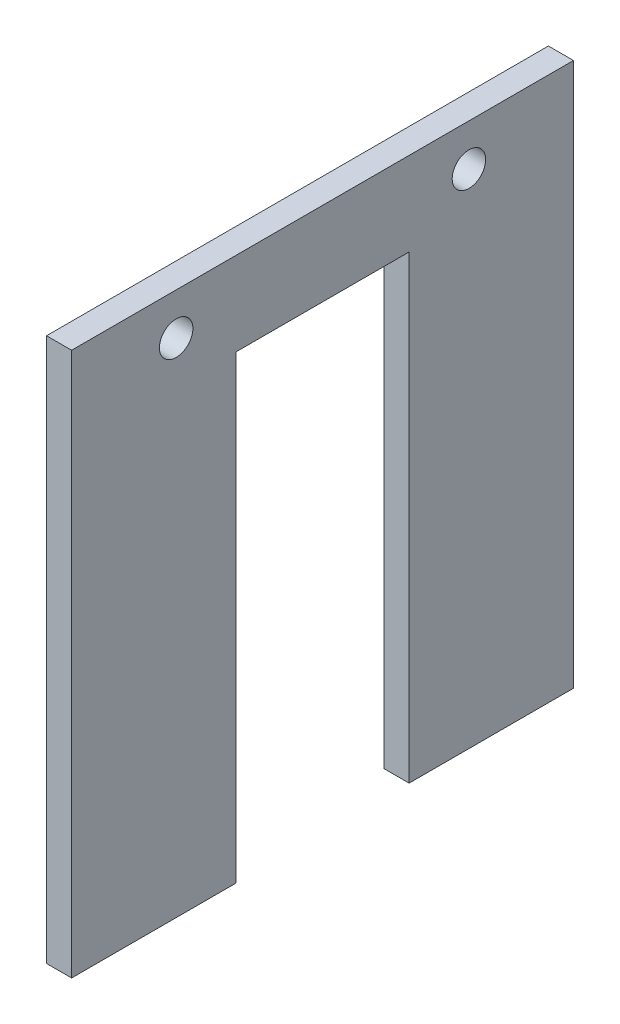
ISO-10303-21;
HEADER;
FILE_DESCRIPTION(('STEP AP214'),'2;1');
FILE_NAME('part.step','',(''),(''),'','','');
FILE_SCHEMA(('AUTOMOTIVE_DESIGN { 1 0 10303 214 1 1 1 1 }'));
ENDSEC;
DATA;
#1=APPLICATION_CONTEXT('core data for automotive mechanical design processes');
#2=APPLICATION_PROTOCOL_DEFINITION('international standard','automotive_design',2000,#1);
#3=PRODUCT_CONTEXT('',#1,'mechanical');
#4=PRODUCT('Part','Part','',(#3));
#5=PRODUCT_RELATED_PRODUCT_CATEGORY('part','',(#4));
#6=PRODUCT_DEFINITION_FORMATION('','',#4);
#7=PRODUCT_DEFINITION_CONTEXT('part definition',#1,'design');
#8=PRODUCT_DEFINITION('design','',#6,#7);
#9=PRODUCT_DEFINITION_SHAPE('','',#8);
#10=(LENGTH_UNIT() NAMED_UNIT(*) SI_UNIT(.MILLI.,.METRE.));
#11=(NAMED_UNIT(*) PLANE_ANGLE_UNIT() SI_UNIT($,.RADIAN.));
#12=(NAMED_UNIT(*) SI_UNIT($,.STERADIAN.) SOLID_ANGLE_UNIT());
#13=UNCERTAINTY_MEASURE_WITH_UNIT(LENGTH_MEASURE(1.E-05),#10,'distance_accuracy_value','');
#14=(GEOMETRIC_REPRESENTATION_CONTEXT(3) GLOBAL_UNCERTAINTY_ASSIGNED_CONTEXT((#13)) GLOBAL_UNIT_ASSIGNED_CONTEXT((#10,
#11,#12)) REPRESENTATION_CONTEXT('',''));
#15=CARTESIAN_POINT('',(0.,0.,0.));
#16=DIRECTION('',(0.,0.,1.));
#17=DIRECTION('',(1.,0.,0.));
#18=AXIS2_PLACEMENT_3D('',#15,#16,#17);
#19=CARTESIAN_POINT('',(3.,0.,0.));
#20=DIRECTION('',(1.,0.,0.));
#21=DIRECTION('',(0.,0.,-1.));
#22=AXIS2_PLACEMENT_3D('',#19,#20,#21);
#23=PLANE('',#22);
#24=CARTESIAN_POINT('',(3.,60.,-12.5));
#25=DIRECTION('',(1.,0.,0.));
#26=DIRECTION('',(0.,0.,-1.));
#27=AXIS2_PLACEMENT_3D('',#24,#25,#26);
#28=CIRCLE('',#27,2.);
#29=CARTESIAN_POINT('',(3.,60.,-14.5));
#30=VERTEX_POINT('',#29);
#31=EDGE_CURVE('E134',#30,#30,#28,.T.);
#32=ORIENTED_EDGE('',*,*,#31,.F.);
#33=EDGE_LOOP('',(#32));
#34=FACE_BOUND('',#33,.T.);
#35=DIRECTION('',(0.,0.,-1.));
#36=VECTOR('',#35,1.);
#37=CARTESIAN_POINT('',(3.,55.,-40.35));
#38=LINE('',#37,#36);
#39=CARTESIAN_POINT('',(3.,55.,-19.65));
#40=VERTEX_POINT('',#39);
#41=CARTESIAN_POINT('',(3.,55.,-40.35));
#42=VERTEX_POINT('',#41);
#43=EDGE_CURVE('E145',#40,#42,#38,.T.);
#44=ORIENTED_EDGE('',*,*,#43,.T.);
#45=DIRECTION('',(0.,-1.,0.));
#46=VECTOR('',#45,1.);
#47=CARTESIAN_POINT('',(3.,0.,-40.35));
#48=LINE('',#47,#46);
#49=CARTESIAN_POINT('',(3.,0.,-40.35));
#50=VERTEX_POINT('',#49);
#51=EDGE_CURVE('E93',#42,#50,#48,.T.);
#52=ORIENTED_EDGE('',*,*,#51,.T.);
#53=DIRECTION('',(0.,0.,-1.));
#54=VECTOR('',#53,1.);
#55=CARTESIAN_POINT('',(3.,0.,-40.35));
#56=LINE('',#55,#54);
#57=CARTESIAN_POINT('',(3.,0.,-60.));
#58=VERTEX_POINT('',#57);
#59=EDGE_CURVE('E160',#50,#58,#56,.T.);
#60=ORIENTED_EDGE('',*,*,#59,.T.);
#61=DIRECTION('',(0.,1.,0.));
#62=VECTOR('',#61,1.);
#63=CARTESIAN_POINT('',(3.,0.,-60.));
#64=LINE('',#63,#62);
#65=CARTESIAN_POINT('',(3.,65.,-60.));
#66=VERTEX_POINT('',#65);
#67=EDGE_CURVE('E173',#58,#66,#64,.T.);
#68=ORIENTED_EDGE('',*,*,#67,.T.);
#69=DIRECTION('',(0.,0.,1.));
#70=VECTOR('',#69,1.);
#71=CARTESIAN_POINT('',(3.,65.,-60.));
#72=LINE('',#71,#70);
#73=CARTESIAN_POINT('',(3.,65.,0.));
#74=VERTEX_POINT('',#73);
#75=EDGE_CURVE('E112',#66,#74,#72,.T.);
#76=ORIENTED_EDGE('',*,*,#75,.T.);
#77=DIRECTION('',(0.,-1.,0.));
#78=VECTOR('',#77,1.);
#79=CARTESIAN_POINT('',(3.,0.,0.));
#80=LINE('',#79,#78);
#81=CARTESIAN_POINT('',(3.,0.,0.));
#82=VERTEX_POINT('',#81);
#83=EDGE_CURVE('E106',#74,#82,#80,.T.);
#84=ORIENTED_EDGE('',*,*,#83,.T.);
#85=DIRECTION('',(0.,0.,-1.));
#86=VECTOR('',#85,1.);
#87=CARTESIAN_POINT('',(3.,0.,-19.65));
#88=LINE('',#87,#86);
#89=CARTESIAN_POINT('',(3.,0.,-19.65));
#90=VERTEX_POINT('',#89);
#91=EDGE_CURVE('E110',#82,#90,#88,.T.);
#92=ORIENTED_EDGE('',*,*,#91,.T.);
#93=DIRECTION('',(0.,1.,0.));
#94=VECTOR('',#93,1.);
#95=CARTESIAN_POINT('',(3.,55.,-19.65));
#96=LINE('',#95,#94);
#97=EDGE_CURVE('E50',#90,#40,#96,.T.);
#98=ORIENTED_EDGE('',*,*,#97,.T.);
#99=EDGE_LOOP('',(#44,#52,#60,#68,#76,#84,#92,#98));
#100=FACE_BOUND('',#99,.T.);
#101=CARTESIAN_POINT('',(3.,60.,-47.5));
#102=DIRECTION('',(1.,0.,0.));
#103=DIRECTION('',(0.,0.,-1.));
#104=AXIS2_PLACEMENT_3D('',#101,#102,#103);
#105=CIRCLE('',#104,2.);
#106=CARTESIAN_POINT('',(3.,60.,-49.5));
#107=VERTEX_POINT('',#106);
#108=EDGE_CURVE('E182',#107,#107,#105,.T.);
#109=ORIENTED_EDGE('',*,*,#108,.F.);
#110=EDGE_LOOP('',(#109));
#111=FACE_BOUND('',#110,.T.);
#112=ADVANCED_FACE('F33',(#34,#100,#111),#23,.T.);
#113=CARTESIAN_POINT('',(0.,0.,0.));
#114=DIRECTION('',(1.,0.,0.));
#115=DIRECTION('',(0.,0.,-1.));
#116=AXIS2_PLACEMENT_3D('',#113,#114,#115);
#117=PLANE('',#116);
#118=DIRECTION('',(0.,0.,-1.));
#119=VECTOR('',#118,1.);
#120=CARTESIAN_POINT('',(0.,55.,-40.35));
#121=LINE('',#120,#119);
#122=CARTESIAN_POINT('',(0.,55.,-19.65));
#123=VERTEX_POINT('',#122);
#124=CARTESIAN_POINT('',(0.,55.,-40.35));
#125=VERTEX_POINT('',#124);
#126=EDGE_CURVE('E130',#123,#125,#121,.T.);
#127=ORIENTED_EDGE('',*,*,#126,.F.);
#128=DIRECTION('',(0.,1.,0.));
#129=VECTOR('',#128,1.);
#130=CARTESIAN_POINT('',(0.,55.,-19.65));
#131=LINE('',#130,#129);
#132=CARTESIAN_POINT('',(0.,0.,-19.65));
#133=VERTEX_POINT('',#132);
#134=EDGE_CURVE('E85',#133,#123,#131,.T.);
#135=ORIENTED_EDGE('',*,*,#134,.F.);
#136=DIRECTION('',(0.,0.,-1.));
#137=VECTOR('',#136,1.);
#138=CARTESIAN_POINT('',(0.,0.,-19.65));
#139=LINE('',#138,#137);
#140=CARTESIAN_POINT('',(0.,0.,0.));
#141=VERTEX_POINT('',#140);
#142=EDGE_CURVE('E79',#141,#133,#139,.T.);
#143=ORIENTED_EDGE('',*,*,#142,.F.);
#144=DIRECTION('',(0.,-1.,0.));
#145=VECTOR('',#144,1.);
#146=CARTESIAN_POINT('',(0.,0.,0.));
#147=LINE('',#146,#145);
#148=CARTESIAN_POINT('',(0.,65.,0.));
#149=VERTEX_POINT('',#148);
#150=EDGE_CURVE('E120',#149,#141,#147,.T.);
#151=ORIENTED_EDGE('',*,*,#150,.F.);
#152=DIRECTION('',(0.,0.,1.));
#153=VECTOR('',#152,1.);
#154=CARTESIAN_POINT('',(0.,65.,-60.));
#155=LINE('',#154,#153);
#156=CARTESIAN_POINT('',(0.,65.,-60.));
#157=VERTEX_POINT('',#156);
#158=EDGE_CURVE('E140',#157,#149,#155,.T.);
#159=ORIENTED_EDGE('',*,*,#158,.F.);
#160=DIRECTION('',(0.,1.,0.));
#161=VECTOR('',#160,1.);
#162=CARTESIAN_POINT('',(0.,0.,-60.));
#163=LINE('',#162,#161);
#164=CARTESIAN_POINT('',(0.,0.,-60.));
#165=VERTEX_POINT('',#164);
#166=EDGE_CURVE('E138',#165,#157,#163,.T.);
#167=ORIENTED_EDGE('',*,*,#166,.F.);
#168=DIRECTION('',(0.,0.,-1.));
#169=VECTOR('',#168,1.);
#170=CARTESIAN_POINT('',(0.,0.,-40.35));
#171=LINE('',#170,#169);
#172=CARTESIAN_POINT('',(0.,0.,-40.35));
#173=VERTEX_POINT('',#172);
#174=EDGE_CURVE('E136',#173,#165,#171,.T.);
#175=ORIENTED_EDGE('',*,*,#174,.F.);
#176=DIRECTION('',(0.,-1.,0.));
#177=VECTOR('',#176,1.);
#178=CARTESIAN_POINT('',(0.,0.,-40.35));
#179=LINE('',#178,#177);
#180=EDGE_CURVE('E133',#125,#173,#179,.T.);
#181=ORIENTED_EDGE('',*,*,#180,.F.);
#182=EDGE_LOOP('',(#127,#135,#143,#151,#159,#167,#175,#181));
#183=FACE_BOUND('',#182,.T.);
#184=CARTESIAN_POINT('',(0.,60.,-12.5));
#185=DIRECTION('',(1.,0.,0.));
#186=DIRECTION('',(0.,0.,-1.));
#187=AXIS2_PLACEMENT_3D('',#184,#185,#186);
#188=CIRCLE('',#187,2.);
#189=CARTESIAN_POINT('',(0.,60.,-14.5));
#190=VERTEX_POINT('',#189);
#191=EDGE_CURVE('E179',#190,#190,#188,.T.);
#192=ORIENTED_EDGE('',*,*,#191,.T.);
#193=EDGE_LOOP('',(#192));
#194=FACE_BOUND('',#193,.T.);
#195=CARTESIAN_POINT('',(0.,60.,-47.5));
#196=DIRECTION('',(1.,0.,0.));
#197=DIRECTION('',(0.,0.,-1.));
#198=AXIS2_PLACEMENT_3D('',#195,#196,#197);
#199=CIRCLE('',#198,2.);
#200=CARTESIAN_POINT('',(0.,60.,-49.5));
#201=VERTEX_POINT('',#200);
#202=EDGE_CURVE('E185',#201,#201,#199,.T.);
#203=ORIENTED_EDGE('',*,*,#202,.T.);
#204=EDGE_LOOP('',(#203));
#205=FACE_BOUND('',#204,.T.);
#206=ADVANCED_FACE('F164',(#183,#194,#205),#117,.F.);
#207=CARTESIAN_POINT('',(3.,55.,-40.35));
#208=DIRECTION('',(0.,1.,0.));
#209=DIRECTION('',(0.,0.,1.));
#210=AXIS2_PLACEMENT_3D('',#207,#208,#209);
#211=PLANE('',#210);
#212=ORIENTED_EDGE('',*,*,#126,.T.);
#213=DIRECTION('',(-1.,0.,0.));
#214=VECTOR('',#213,1.);
#215=CARTESIAN_POINT('',(3.,55.,-40.35));
#216=LINE('',#215,#214);
#217=EDGE_CURVE('E11',#42,#125,#216,.T.);
#218=ORIENTED_EDGE('',*,*,#217,.F.);
#219=ORIENTED_EDGE('',*,*,#43,.F.);
#220=DIRECTION('',(-1.,0.,0.));
#221=VECTOR('',#220,1.);
#222=CARTESIAN_POINT('',(3.,55.,-19.65));
#223=LINE('',#222,#221);
#224=EDGE_CURVE('E126',#40,#123,#223,.T.);
#225=ORIENTED_EDGE('',*,*,#224,.T.);
#226=EDGE_LOOP('',(#212,#218,#219,#225));
#227=FACE_BOUND('',#226,.T.);
#228=ADVANCED_FACE('F35',(#227),#211,.F.);
#229=CARTESIAN_POINT('',(3.,0.,-40.35));
#230=DIRECTION('',(0.,0.,-1.));
#231=DIRECTION('',(0.,1.,0.));
#232=AXIS2_PLACEMENT_3D('',#229,#230,#231);
#233=PLANE('',#232);
#234=ORIENTED_EDGE('',*,*,#180,.T.);
#235=DIRECTION('',(-1.,0.,0.));
#236=VECTOR('',#235,1.);
#237=CARTESIAN_POINT('',(3.,0.,-40.35));
#238=LINE('',#237,#236);
#239=EDGE_CURVE('E42',#50,#173,#238,.T.);
#240=ORIENTED_EDGE('',*,*,#239,.F.);
#241=ORIENTED_EDGE('',*,*,#51,.F.);
#242=ORIENTED_EDGE('',*,*,#217,.T.);
#243=EDGE_LOOP('',(#234,#240,#241,#242));
#244=FACE_BOUND('',#243,.T.);
#245=ADVANCED_FACE('F217',(#244),#233,.F.);
#246=CARTESIAN_POINT('',(3.,0.,-40.35));
#247=DIRECTION('',(0.,1.,0.));
#248=DIRECTION('',(0.,0.,1.));
#249=AXIS2_PLACEMENT_3D('',#246,#247,#248);
#250=PLANE('',#249);
#251=ORIENTED_EDGE('',*,*,#174,.T.);
#252=DIRECTION('',(-1.,0.,0.));
#253=VECTOR('',#252,1.);
#254=CARTESIAN_POINT('',(3.,0.,-60.));
#255=LINE('',#254,#253);
#256=EDGE_CURVE('E152',#58,#165,#255,.T.);
#257=ORIENTED_EDGE('',*,*,#256,.F.);
#258=ORIENTED_EDGE('',*,*,#59,.F.);
#259=ORIENTED_EDGE('',*,*,#239,.T.);
#260=EDGE_LOOP('',(#251,#257,#258,#259));
#261=FACE_BOUND('',#260,.T.);
#262=ADVANCED_FACE('F158',(#261),#250,.F.);
#263=CARTESIAN_POINT('',(3.,0.,-60.));
#264=DIRECTION('',(0.,0.,1.));
#265=DIRECTION('',(1.,0.,0.));
#266=AXIS2_PLACEMENT_3D('',#263,#264,#265);
#267=PLANE('',#266);
#268=ORIENTED_EDGE('',*,*,#166,.T.);
#269=DIRECTION('',(-1.,0.,0.));
#270=VECTOR('',#269,1.);
#271=CARTESIAN_POINT('',(3.,65.,-60.));
#272=LINE('',#271,#270);
#273=EDGE_CURVE('E149',#66,#157,#272,.T.);
#274=ORIENTED_EDGE('',*,*,#273,.F.);
#275=ORIENTED_EDGE('',*,*,#67,.F.);
#276=ORIENTED_EDGE('',*,*,#256,.T.);
#277=EDGE_LOOP('',(#268,#274,#275,#276));
#278=FACE_BOUND('',#277,.T.);
#279=ADVANCED_FACE('F169',(#278),#267,.F.);
#280=CARTESIAN_POINT('',(3.,65.,-60.));
#281=DIRECTION('',(0.,-1.,0.));
#282=DIRECTION('',(0.,0.,-1.));
#283=AXIS2_PLACEMENT_3D('',#280,#281,#282);
#284=PLANE('',#283);
#285=ORIENTED_EDGE('',*,*,#158,.T.);
#286=DIRECTION('',(-1.,0.,0.));
#287=VECTOR('',#286,1.);
#288=CARTESIAN_POINT('',(3.,65.,0.));
#289=LINE('',#288,#287);
#290=EDGE_CURVE('E121',#74,#149,#289,.T.);
#291=ORIENTED_EDGE('',*,*,#290,.F.);
#292=ORIENTED_EDGE('',*,*,#75,.F.);
#293=ORIENTED_EDGE('',*,*,#273,.T.);
#294=EDGE_LOOP('',(#285,#291,#292,#293));
#295=FACE_BOUND('',#294,.T.);
#296=ADVANCED_FACE('F172',(#295),#284,.F.);
#297=CARTESIAN_POINT('',(3.,0.,0.));
#298=DIRECTION('',(0.,0.,-1.));
#299=DIRECTION('',(-1.,0.,0.));
#300=AXIS2_PLACEMENT_3D('',#297,#298,#299);
#301=PLANE('',#300);
#302=ORIENTED_EDGE('',*,*,#150,.T.);
#303=DIRECTION('',(-1.,0.,0.));
#304=VECTOR('',#303,1.);
#305=CARTESIAN_POINT('',(3.,0.,0.));
#306=LINE('',#305,#304);
#307=EDGE_CURVE('E117',#82,#141,#306,.T.);
#308=ORIENTED_EDGE('',*,*,#307,.F.);
#309=ORIENTED_EDGE('',*,*,#83,.F.);
#310=ORIENTED_EDGE('',*,*,#290,.T.);
#311=EDGE_LOOP('',(#302,#308,#309,#310));
#312=FACE_BOUND('',#311,.T.);
#313=ADVANCED_FACE('F118',(#312),#301,.F.);
#314=CARTESIAN_POINT('',(3.,0.,-19.65));
#315=DIRECTION('',(0.,1.,0.));
#316=DIRECTION('',(0.,0.,1.));
#317=AXIS2_PLACEMENT_3D('',#314,#315,#316);
#318=PLANE('',#317);
#319=ORIENTED_EDGE('',*,*,#142,.T.);
#320=DIRECTION('',(-1.,0.,0.));
#321=VECTOR('',#320,1.);
#322=CARTESIAN_POINT('',(3.,0.,-19.65));
#323=LINE('',#322,#321);
#324=EDGE_CURVE('E122',#90,#133,#323,.T.);
#325=ORIENTED_EDGE('',*,*,#324,.F.);
#326=ORIENTED_EDGE('',*,*,#91,.F.);
#327=ORIENTED_EDGE('',*,*,#307,.T.);
#328=EDGE_LOOP('',(#319,#325,#326,#327));
#329=FACE_BOUND('',#328,.T.);
#330=ADVANCED_FACE('F124',(#329),#318,.F.);
#331=CARTESIAN_POINT('',(3.,55.,-19.65));
#332=DIRECTION('',(0.,0.,1.));
#333=DIRECTION('',(0.,-1.,0.));
#334=AXIS2_PLACEMENT_3D('',#331,#332,#333);
#335=PLANE('',#334);
#336=ORIENTED_EDGE('',*,*,#134,.T.);
#337=ORIENTED_EDGE('',*,*,#224,.F.);
#338=ORIENTED_EDGE('',*,*,#97,.F.);
#339=ORIENTED_EDGE('',*,*,#324,.T.);
#340=EDGE_LOOP('',(#336,#337,#338,#339));
#341=FACE_BOUND('',#340,.T.);
#342=ADVANCED_FACE('F205',(#341),#335,.F.);
#343=CARTESIAN_POINT('',(3.,60.,-12.5));
#344=DIRECTION('',(-1.,0.,0.));
#345=DIRECTION('',(0.,0.,1.));
#346=AXIS2_PLACEMENT_3D('',#343,#344,#345);
#347=CYLINDRICAL_SURFACE('',#346,2.);
#348=ORIENTED_EDGE('',*,*,#31,.T.);
#349=EDGE_LOOP('',(#348));
#350=FACE_BOUND('',#349,.T.);
#351=ORIENTED_EDGE('',*,*,#191,.F.);
#352=EDGE_LOOP('',(#351));
#353=FACE_BOUND('',#352,.T.);
#354=ADVANCED_FACE('F202',(#350,#353),#347,.F.);
#355=CARTESIAN_POINT('',(3.,60.,-47.5));
#356=DIRECTION('',(-1.,0.,0.));
#357=DIRECTION('',(0.,0.,1.));
#358=AXIS2_PLACEMENT_3D('',#355,#356,#357);
#359=CYLINDRICAL_SURFACE('',#358,2.);
#360=ORIENTED_EDGE('',*,*,#108,.T.);
#361=EDGE_LOOP('',(#360));
#362=FACE_BOUND('',#361,.T.);
#363=ORIENTED_EDGE('',*,*,#202,.F.);
#364=EDGE_LOOP('',(#363));
#365=FACE_BOUND('',#364,.T.);
#366=ADVANCED_FACE('F191',(#362,#365),#359,.F.);
#367=CLOSED_SHELL('',(#112,#206,#228,#245,#262,#279,#296,#313,#330,#342,#354,#366));
#368=MANIFOLD_SOLID_BREP('B2',#367);
#369=ADVANCED_BREP_SHAPE_REPRESENTATION('',(#18,#368),#14);
#370=SHAPE_DEFINITION_REPRESENTATION(#9,#369);
ENDSEC;
END-ISO-10303-21;
